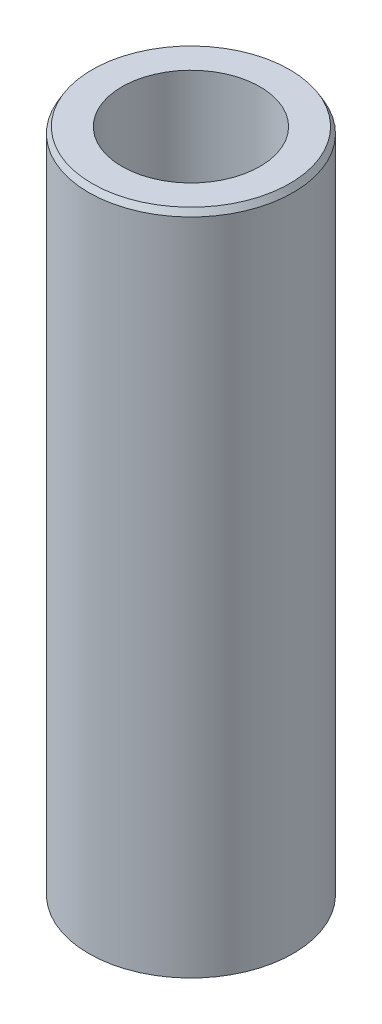
ISO-10303-21;
HEADER;
FILE_DESCRIPTION(('STEP AP214'),'2;1');
FILE_NAME('part.step','',(''),(''),'','','');
FILE_SCHEMA(('AUTOMOTIVE_DESIGN { 1 0 10303 214 1 1 1 1 }'));
ENDSEC;
DATA;
#1=APPLICATION_CONTEXT('core data for automotive mechanical design processes');
#2=APPLICATION_PROTOCOL_DEFINITION('international standard','automotive_design',2000,#1);
#3=PRODUCT_CONTEXT('',#1,'mechanical');
#4=PRODUCT('Part','Part','',(#3));
#5=PRODUCT_RELATED_PRODUCT_CATEGORY('part','',(#4));
#6=PRODUCT_DEFINITION_FORMATION('','',#4);
#7=PRODUCT_DEFINITION_CONTEXT('part definition',#1,'design');
#8=PRODUCT_DEFINITION('design','',#6,#7);
#9=PRODUCT_DEFINITION_SHAPE('','',#8);
#10=(LENGTH_UNIT() NAMED_UNIT(*) SI_UNIT(.MILLI.,.METRE.));
#11=(NAMED_UNIT(*) PLANE_ANGLE_UNIT() SI_UNIT($,.RADIAN.));
#12=(NAMED_UNIT(*) SI_UNIT($,.STERADIAN.) SOLID_ANGLE_UNIT());
#13=UNCERTAINTY_MEASURE_WITH_UNIT(LENGTH_MEASURE(1.E-05),#10,'distance_accuracy_value','');
#14=(GEOMETRIC_REPRESENTATION_CONTEXT(3) GLOBAL_UNCERTAINTY_ASSIGNED_CONTEXT((#13)) GLOBAL_UNIT_ASSIGNED_CONTEXT((#10,
#11,#12)) REPRESENTATION_CONTEXT('',''));
#15=CARTESIAN_POINT('',(0.,0.,0.));
#16=DIRECTION('',(0.,0.,1.));
#17=DIRECTION('',(1.,0.,0.));
#18=AXIS2_PLACEMENT_3D('',#15,#16,#17);
#19=CARTESIAN_POINT('',(0.,392.429999854871,0.));
#20=DIRECTION('',(0.,-1.,0.));
#21=DIRECTION('',(0.,0.,-1.));
#22=AXIS2_PLACEMENT_3D('',#19,#20,#21);
#23=CYLINDRICAL_SURFACE('',#22,60.);
#24=CARTESIAN_POINT('',(0.,388.894469828263,0.));
#25=DIRECTION('',(0.,1.,0.));
#26=DIRECTION('',(0.,0.,1.));
#27=AXIS2_PLACEMENT_3D('',#24,#25,#26);
#28=CIRCLE('',#27,60.);
#29=CARTESIAN_POINT('',(0.,388.894469828263,60.));
#30=VERTEX_POINT('',#29);
#31=EDGE_CURVE('E50',#30,#30,#28,.F.);
#32=ORIENTED_EDGE('',*,*,#31,.T.);
#33=EDGE_LOOP('',(#32));
#34=FACE_BOUND('',#33,.T.);
#35=CARTESIAN_POINT('',(0.,2.04123921259003,0.));
#36=DIRECTION('',(0.,1.,0.));
#37=DIRECTION('',(0.,0.,1.));
#38=AXIS2_PLACEMENT_3D('',#35,#36,#37);
#39=CIRCLE('',#38,60.);
#40=CARTESIAN_POINT('',(0.,2.04123921259003,60.));
#41=VERTEX_POINT('',#40);
#42=EDGE_CURVE('E51',#41,#41,#39,.T.);
#43=ORIENTED_EDGE('',*,*,#42,.T.);
#44=EDGE_LOOP('',(#43));
#45=FACE_BOUND('',#44,.T.);
#46=ADVANCED_FACE('F39',(#34,#45),#23,.T.);
#47=CARTESIAN_POINT('',(0.,392.429999854871,0.));
#48=DIRECTION('',(0.,1.,0.));
#49=DIRECTION('',(0.,0.,1.));
#50=AXIS2_PLACEMENT_3D('',#47,#48,#49);
#51=PLANE('',#50);
#52=CARTESIAN_POINT('',(0.,392.429999854871,0.));
#53=DIRECTION('',(0.,1.,0.));
#54=DIRECTION('',(0.,0.,1.));
#55=AXIS2_PLACEMENT_3D('',#52,#53,#54);
#56=CIRCLE('',#55,57.95876078741);
#57=CARTESIAN_POINT('',(0.,392.429999854871,57.95876078741));
#58=VERTEX_POINT('',#57);
#59=EDGE_CURVE('E54',#58,#58,#56,.T.);
#60=ORIENTED_EDGE('',*,*,#59,.T.);
#61=EDGE_LOOP('',(#60));
#62=FACE_BOUND('',#61,.T.);
#63=CARTESIAN_POINT('',(0.,392.429999854871,0.));
#64=DIRECTION('',(0.,1.,0.));
#65=DIRECTION('',(0.,0.,1.));
#66=AXIS2_PLACEMENT_3D('',#63,#64,#65);
#67=CIRCLE('',#66,40.5347840646084);
#68=CARTESIAN_POINT('',(0.,392.429999854871,40.5347840646084));
#69=VERTEX_POINT('',#68);
#70=EDGE_CURVE('E58',#69,#69,#67,.T.);
#71=ORIENTED_EDGE('',*,*,#70,.F.);
#72=EDGE_LOOP('',(#71));
#73=FACE_BOUND('',#72,.T.);
#74=ADVANCED_FACE('F69',(#62,#73),#51,.T.);
#75=CARTESIAN_POINT('',(0.,0.,0.));
#76=DIRECTION('',(0.,1.,0.));
#77=DIRECTION('',(0.,0.,1.));
#78=AXIS2_PLACEMENT_3D('',#75,#76,#77);
#79=PLANE('',#78);
#80=CARTESIAN_POINT('',(0.,0.,0.));
#81=DIRECTION('',(0.,1.,0.));
#82=DIRECTION('',(0.,0.,1.));
#83=AXIS2_PLACEMENT_3D('',#80,#81,#82);
#84=CIRCLE('',#83,56.4644699733921);
#85=CARTESIAN_POINT('',(0.,0.,56.4644699733921));
#86=VERTEX_POINT('',#85);
#87=EDGE_CURVE('E10',#86,#86,#84,.F.);
#88=ORIENTED_EDGE('',*,*,#87,.T.);
#89=EDGE_LOOP('',(#88));
#90=FACE_BOUND('',#89,.T.);
#91=CARTESIAN_POINT('',(0.,0.,0.));
#92=DIRECTION('',(0.,1.,0.));
#93=DIRECTION('',(0.,0.,1.));
#94=AXIS2_PLACEMENT_3D('',#91,#92,#93);
#95=CIRCLE('',#94,40.5347840646084);
#96=CARTESIAN_POINT('',(0.,0.,40.5347840646084));
#97=VERTEX_POINT('',#96);
#98=EDGE_CURVE('E63',#97,#97,#95,.T.);
#99=ORIENTED_EDGE('',*,*,#98,.T.);
#100=EDGE_LOOP('',(#99));
#101=FACE_BOUND('',#100,.T.);
#102=ADVANCED_FACE('F75',(#90,#101),#79,.F.);
#103=CARTESIAN_POINT('',(0.,392.429999854871,0.));
#104=DIRECTION('',(0.,-1.,0.));
#105=DIRECTION('',(0.,0.,-1.));
#106=AXIS2_PLACEMENT_3D('',#103,#104,#105);
#107=CYLINDRICAL_SURFACE('',#106,40.5347840646084);
#108=ORIENTED_EDGE('',*,*,#70,.T.);
#109=EDGE_LOOP('',(#108));
#110=FACE_BOUND('',#109,.T.);
#111=ORIENTED_EDGE('',*,*,#98,.F.);
#112=EDGE_LOOP('',(#111));
#113=FACE_BOUND('',#112,.T.);
#114=ADVANCED_FACE('F70',(#110,#113),#107,.F.);
#115=CARTESIAN_POINT('',(0.,392.429999854871,0.));
#116=DIRECTION('',(0.,-1.,0.));
#117=DIRECTION('',(0.,0.,-1.));
#118=AXIS2_PLACEMENT_3D('',#115,#116,#117);
#119=CONICAL_SURFACE('',#118,57.95876078741,0.52359877559829);
#120=ORIENTED_EDGE('',*,*,#31,.F.);
#121=EDGE_LOOP('',(#120));
#122=FACE_BOUND('',#121,.T.);
#123=ORIENTED_EDGE('',*,*,#59,.F.);
#124=EDGE_LOOP('',(#123));
#125=FACE_BOUND('',#124,.T.);
#126=ADVANCED_FACE('F81',(#122,#125),#119,.T.);
#127=CARTESIAN_POINT('',(0.,2.04123921259003,0.));
#128=DIRECTION('',(0.,1.,0.));
#129=DIRECTION('',(0.,0.,1.));
#130=AXIS2_PLACEMENT_3D('',#127,#128,#129);
#131=CONICAL_SURFACE('',#130,60.,1.04719755119661);
#132=CARTESIAN_POINT('',(0.,0.,56.4644699733921));
#133=CARTESIAN_POINT('',(0.,0.0212629084644808,56.5012984111693));
#134=CARTESIAN_POINT('',(0.,0.0425258169289596,56.5381268489464));
#135=CARTESIAN_POINT('',(0.,0.0850516338579173,56.6117837245008));
#136=CARTESIAN_POINT('',(0.,0.106314542322396,56.6486121622779));
#137=CARTESIAN_POINT('',(0.,0.148840359251355,56.7222690378323));
#138=CARTESIAN_POINT('',(0.,0.170103267715836,56.7590974756094));
#139=CARTESIAN_POINT('',(0.,0.212629084644795,56.8327543511638));
#140=CARTESIAN_POINT('',(0.,0.233891993109273,56.8695827889409));
#141=CARTESIAN_POINT('',(0.,0.276417810038232,56.9432396644953));
#142=CARTESIAN_POINT('',(0.,0.297680718502712,56.9800681022724));
#143=CARTESIAN_POINT('',(0.,0.340206535431671,57.0537249778268));
#144=CARTESIAN_POINT('',(0.,0.36146944389615,57.0905534156039));
#145=CARTESIAN_POINT('',(0.,0.403995260825109,57.1642102911582));
#146=CARTESIAN_POINT('',(0.,0.425258169289589,57.2010387289354));
#147=CARTESIAN_POINT('',(0.,0.467783986218548,57.2746956044897));
#148=CARTESIAN_POINT('',(0.,0.489046894683027,57.3115240422669));
#149=CARTESIAN_POINT('',(0.,0.531572711611986,57.3851809178212));
#150=CARTESIAN_POINT('',(0.,0.552835620076466,57.4220093555984));
#151=CARTESIAN_POINT('',(0.,0.595361437005425,57.4956662311527));
#152=CARTESIAN_POINT('',(0.,0.616624345469904,57.5324946689299));
#153=CARTESIAN_POINT('',(0.,0.659150162398863,57.6061515444842));
#154=CARTESIAN_POINT('',(0.,0.680413070863343,57.6429799822614));
#155=CARTESIAN_POINT('',(0.,0.722938887792302,57.7166368578157));
#156=CARTESIAN_POINT('',(0.,0.744201796256781,57.7534652955929));
#157=CARTESIAN_POINT('',(0.,0.78672761318574,57.8271221711472));
#158=CARTESIAN_POINT('',(0.,0.80799052165022,57.8639506089244));
#159=CARTESIAN_POINT('',(0.,0.850516338579179,57.9376074844787));
#160=CARTESIAN_POINT('',(0.,0.871779247043658,57.9744359222559));
#161=CARTESIAN_POINT('',(0.,0.914305063972616,58.0480927978102));
#162=CARTESIAN_POINT('',(0.,0.935567972437097,58.0849212355874));
#163=CARTESIAN_POINT('',(0.,0.978093789366056,58.1585781111417));
#164=CARTESIAN_POINT('',(0.,0.999356697830534,58.1954065489189));
#165=CARTESIAN_POINT('',(0.,1.04188251475949,58.2690634244732));
#166=CARTESIAN_POINT('',(0.,1.06314542322397,58.3058918622504));
#167=CARTESIAN_POINT('',(0.,1.10567124015293,58.3795487378047));
#168=CARTESIAN_POINT('',(0.,1.12693414861741,58.4163771755819));
#169=CARTESIAN_POINT('',(0.,1.16945996554637,58.4900340511362));
#170=CARTESIAN_POINT('',(0.,1.19072287401085,58.5268624889134));
#171=CARTESIAN_POINT('',(0.,1.23324869093981,58.6005193644677));
#172=CARTESIAN_POINT('',(0.,1.25451159940429,58.6373478022449));
#173=CARTESIAN_POINT('',(0.,1.29703741633325,58.7110046777992));
#174=CARTESIAN_POINT('',(0.,1.31830032479773,58.7478331155764));
#175=CARTESIAN_POINT('',(0.,1.36082614172669,58.8214899911307));
#176=CARTESIAN_POINT('',(0.,1.38208905019116,58.8583184289079));
#177=CARTESIAN_POINT('',(0.,1.42461486712012,58.9319753044622));
#178=CARTESIAN_POINT('',(0.,1.4458777755846,58.9688037422394));
#179=CARTESIAN_POINT('',(0.,1.48840359251356,59.0424606177937));
#180=CARTESIAN_POINT('',(0.,1.50966650097804,59.0792890555709));
#181=CARTESIAN_POINT('',(0.,1.552192317907,59.1529459311252));
#182=CARTESIAN_POINT('',(0.,1.57345522637148,59.1897743689024));
#183=CARTESIAN_POINT('',(0.,1.61598104330044,59.2634312444567));
#184=CARTESIAN_POINT('',(0.,1.63724395176492,59.3002596822339));
#185=CARTESIAN_POINT('',(0.,1.67976976869388,59.3739165577882));
#186=CARTESIAN_POINT('',(0.,1.70103267715836,59.4107449955653));
#187=CARTESIAN_POINT('',(0.,1.74355849408732,59.4844018711197));
#188=CARTESIAN_POINT('',(0.,1.7648214025518,59.5212303088968));
#189=CARTESIAN_POINT('',(0.,1.80734721948075,59.5948871844512));
#190=CARTESIAN_POINT('',(0.,1.82861012794523,59.6317156222283));
#191=CARTESIAN_POINT('',(0.,1.87113594487419,59.7053724977827));
#192=CARTESIAN_POINT('',(0.,1.89239885333867,59.7422009355598));
#193=CARTESIAN_POINT('',(0.,1.93492467026763,59.8158578111142));
#194=CARTESIAN_POINT('',(0.,1.95618757873211,59.8526862488913));
#195=CARTESIAN_POINT('',(0.,1.99871339566107,59.9263431244457));
#196=CARTESIAN_POINT('',(0.,2.01997630412555,59.9631715622228));
#197=CARTESIAN_POINT('',(0.,2.04123921259003,60.));
#198=B_SPLINE_CURVE_WITH_KNOTS('',3,(#132,#133,#134,#135,#136,#137,#138,#139,#140,#141,#142,
#143,#144,#145,#146,#147,#148,#149,#150,#151,#152,#153,#154,#155,#156,#157,#158,#159,#160,#161,
#162,#163,#164,#165,#166,#167,#168,#169,#170,#171,#172,#173,#174,#175,#176,#177,#178,#179,#180,
#181,#182,#183,#184,#185,#186,#187,#188,#189,#190,#191,#192,#193,#194,#195,#196,#197),
.UNSPECIFIED.,.F.,.F.,(4,2,2,2,2,2,2,2,2,2,2,2,2,2,2,2,2,2,2,2,2,2,2,2,2,2,2,2,2,2,2,2,4),(0.,
0.127577450786876,0.255154901573757,0.382732352360633,0.510309803147515,0.637887253934391,
0.765464704721273,0.893042155508148,1.02061960629503,1.14819705708191,1.27577450786879,
1.40335195865566,1.53092940944255,1.65850686022942,1.7860843110163,1.91366176180318,
2.04123921259006,2.16881666337694,2.29639411416382,2.42397156495069,2.55154901573757,
2.67912646652445,2.80670391731133,2.93428136809821,3.06185881888509,3.18943626967197,
3.31701372045885,3.44459117124572,3.57216862203261,3.69974607281948,3.82732352360636,
3.95490097439324,4.08247842518012),.UNSPECIFIED.);
#199=EDGE_CURVE('BSEAM45',#86,#41,#198,.T.);
#200=ORIENTED_EDGE('',*,*,#87,.F.);
#201=ORIENTED_EDGE('',*,*,#42,.F.);
#202=ORIENTED_EDGE('',*,*,#199,.T.);
#203=ORIENTED_EDGE('',*,*,#199,.F.);
#204=EDGE_LOOP('',(#200,#202,#201,#203));
#205=FACE_BOUND('',#204,.T.);
#206=ADVANCED_FACE('F45',(#205),#131,.T.);
#207=CLOSED_SHELL('',(#46,#74,#102,#114,#126,#206));
#208=MANIFOLD_SOLID_BREP('B2',#207);
#209=ADVANCED_BREP_SHAPE_REPRESENTATION('',(#18,#208),#14);
#210=SHAPE_DEFINITION_REPRESENTATION(#9,#209);
ENDSEC;
END-ISO-10303-21;
